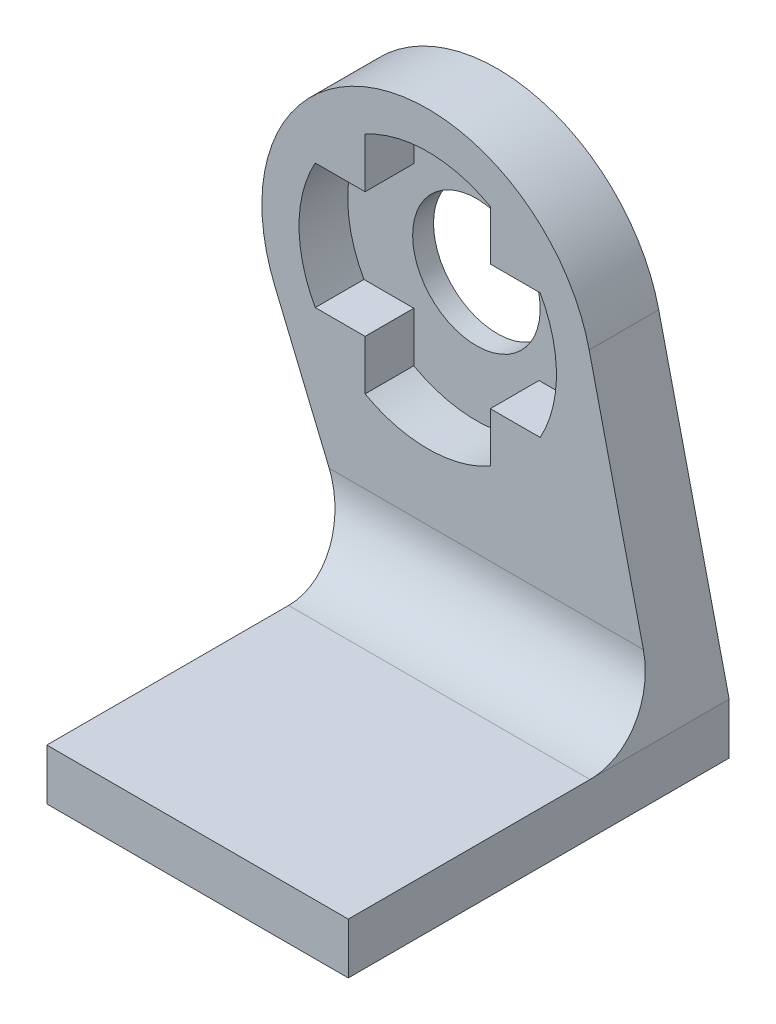
ISO-10303-21;
HEADER;
FILE_DESCRIPTION(('STEP AP214'),'2;1');
FILE_NAME('part.step','',(''),(''),'','','');
FILE_SCHEMA(('AUTOMOTIVE_DESIGN { 1 0 10303 214 1 1 1 1 }'));
ENDSEC;
DATA;
#1=APPLICATION_CONTEXT('core data for automotive mechanical design processes');
#2=APPLICATION_PROTOCOL_DEFINITION('international standard','automotive_design',2000,#1);
#3=PRODUCT_CONTEXT('',#1,'mechanical');
#4=PRODUCT('Part','Part','',(#3));
#5=PRODUCT_RELATED_PRODUCT_CATEGORY('part','',(#4));
#6=PRODUCT_DEFINITION_FORMATION('','',#4);
#7=PRODUCT_DEFINITION_CONTEXT('part definition',#1,'design');
#8=PRODUCT_DEFINITION('design','',#6,#7);
#9=PRODUCT_DEFINITION_SHAPE('','',#8);
#10=(LENGTH_UNIT() NAMED_UNIT(*) SI_UNIT(.MILLI.,.METRE.));
#11=(NAMED_UNIT(*) PLANE_ANGLE_UNIT() SI_UNIT($,.RADIAN.));
#12=(NAMED_UNIT(*) SI_UNIT($,.STERADIAN.) SOLID_ANGLE_UNIT());
#13=UNCERTAINTY_MEASURE_WITH_UNIT(LENGTH_MEASURE(1.E-05),#10,'distance_accuracy_value','');
#14=(GEOMETRIC_REPRESENTATION_CONTEXT(3) GLOBAL_UNCERTAINTY_ASSIGNED_CONTEXT((#13)) GLOBAL_UNIT_ASSIGNED_CONTEXT((#10,
#11,#12)) REPRESENTATION_CONTEXT('',''));
#15=CARTESIAN_POINT('',(0.,0.,0.));
#16=DIRECTION('',(0.,0.,1.));
#17=DIRECTION('',(1.,0.,0.));
#18=AXIS2_PLACEMENT_3D('',#15,#16,#17);
#19=CARTESIAN_POINT('',(12.9998092376302,-81.8996521323785,-19.85));
#20=DIRECTION('',(0.,0.,1.));
#21=DIRECTION('',(-1.,0.,0.));
#22=AXIS2_PLACEMENT_3D('',#19,#20,#21);
#23=PLANE('',#22);
#24=CARTESIAN_POINT('',(12.9999812376302,-81.8993076323785,-19.85));
#25=DIRECTION('',(0.,0.,-1.));
#26=DIRECTION('',(-1.,0.,0.));
#27=AXIS2_PLACEMENT_3D('',#24,#25,#26);
#28=CIRCLE('',#27,2.75);
#29=CARTESIAN_POINT('',(10.2499812376302,-81.8993076323785,-19.85));
#30=VERTEX_POINT('',#29);
#31=EDGE_CURVE('E367',#30,#30,#28,.T.);
#32=ORIENTED_EDGE('',*,*,#31,.T.);
#33=EDGE_LOOP('',(#32));
#34=FACE_BOUND('',#33,.T.);
#35=DIRECTION('',(0.,-1.,0.));
#36=VECTOR('',#35,1.);
#37=CARTESIAN_POINT('',(15.6998092376302,-77.1372997724622,-19.85));
#38=LINE('',#37,#36);
#39=CARTESIAN_POINT('',(15.6998092376302,-77.0506831698051,-19.85));
#40=VERTEX_POINT('',#39);
#41=CARTESIAN_POINT('',(15.6998092376302,-79.1996521323784,-19.85));
#42=VERTEX_POINT('',#41);
#43=EDGE_CURVE('E298',#40,#42,#38,.T.);
#44=ORIENTED_EDGE('',*,*,#43,.F.);
#45=CARTESIAN_POINT('',(12.9998092376302,-81.8996521323785,-19.85));
#46=DIRECTION('',(0.,0.,-1.));
#47=DIRECTION('',(-1.,0.,0.));
#48=AXIS2_PLACEMENT_3D('',#45,#46,#47);
#49=CIRCLE('',#48,5.55000000000001);
#50=CARTESIAN_POINT('',(10.2998092376302,-77.0506831698051,-19.85));
#51=VERTEX_POINT('',#50);
#52=EDGE_CURVE('E264',#51,#40,#49,.T.);
#53=ORIENTED_EDGE('',*,*,#52,.F.);
#54=DIRECTION('',(0.,1.,0.));
#55=VECTOR('',#54,1.);
#56=CARTESIAN_POINT('',(10.2998092376302,-77.1372997724622,-19.85));
#57=LINE('',#56,#55);
#58=CARTESIAN_POINT('',(10.2998092376302,-79.1996521323784,-19.85));
#59=VERTEX_POINT('',#58);
#60=EDGE_CURVE('E335',#59,#51,#57,.T.);
#61=ORIENTED_EDGE('',*,*,#60,.F.);
#62=DIRECTION('',(1.,0.,0.));
#63=VECTOR('',#62,1.);
#64=CARTESIAN_POINT('',(8.23745687771393,-79.1996521323784,-19.85));
#65=LINE('',#64,#63);
#66=CARTESIAN_POINT('',(8.15084027505681,-79.1996521323784,-19.85));
#67=VERTEX_POINT('',#66);
#68=EDGE_CURVE('E338',#67,#59,#65,.T.);
#69=ORIENTED_EDGE('',*,*,#68,.F.);
#70=CARTESIAN_POINT('',(12.9998092376302,-81.8996521323785,-19.85));
#71=DIRECTION('',(0.,0.,-1.));
#72=DIRECTION('',(-1.,0.,0.));
#73=AXIS2_PLACEMENT_3D('',#70,#71,#72);
#74=CIRCLE('',#73,5.55);
#75=CARTESIAN_POINT('',(8.15084027505681,-84.5996521323785,-19.85));
#76=VERTEX_POINT('',#75);
#77=EDGE_CURVE('E341',#76,#67,#74,.T.);
#78=ORIENTED_EDGE('',*,*,#77,.F.);
#79=DIRECTION('',(-1.,0.,0.));
#80=VECTOR('',#79,1.);
#81=CARTESIAN_POINT('',(8.23745687771393,-84.5996521323785,-19.85));
#82=LINE('',#81,#80);
#83=CARTESIAN_POINT('',(10.2998092376302,-84.5996521323785,-19.85));
#84=VERTEX_POINT('',#83);
#85=EDGE_CURVE('E344',#84,#76,#82,.T.);
#86=ORIENTED_EDGE('',*,*,#85,.F.);
#87=DIRECTION('',(0.,1.,0.));
#88=VECTOR('',#87,1.);
#89=CARTESIAN_POINT('',(10.2998092376302,-86.6620044922947,-19.85));
#90=LINE('',#89,#88);
#91=CARTESIAN_POINT('',(10.2998092376302,-86.7486210949518,-19.85));
#92=VERTEX_POINT('',#91);
#93=EDGE_CURVE('E347',#92,#84,#90,.T.);
#94=ORIENTED_EDGE('',*,*,#93,.F.);
#95=CARTESIAN_POINT('',(12.9998092376302,-81.8996521323785,-19.85));
#96=DIRECTION('',(0.,0.,-1.));
#97=DIRECTION('',(-1.,0.,0.));
#98=AXIS2_PLACEMENT_3D('',#95,#96,#97);
#99=CIRCLE('',#98,5.55000000000001);
#100=CARTESIAN_POINT('',(15.6998092376302,-86.7486210949518,-19.85));
#101=VERTEX_POINT('',#100);
#102=EDGE_CURVE('E350',#101,#92,#99,.T.);
#103=ORIENTED_EDGE('',*,*,#102,.F.);
#104=DIRECTION('',(0.,-1.,0.));
#105=VECTOR('',#104,1.);
#106=CARTESIAN_POINT('',(15.6998092376302,-86.6620044922947,-19.85));
#107=LINE('',#106,#105);
#108=CARTESIAN_POINT('',(15.6998092376302,-84.5996521323785,-19.85));
#109=VERTEX_POINT('',#108);
#110=EDGE_CURVE('E353',#109,#101,#107,.T.);
#111=ORIENTED_EDGE('',*,*,#110,.F.);
#112=DIRECTION('',(-1.,0.,0.));
#113=VECTOR('',#112,1.);
#114=CARTESIAN_POINT('',(17.7621615975465,-84.5996521323785,-19.85));
#115=LINE('',#114,#113);
#116=CARTESIAN_POINT('',(17.8487782002036,-84.5996521323785,-19.85));
#117=VERTEX_POINT('',#116);
#118=EDGE_CURVE('E356',#117,#109,#115,.T.);
#119=ORIENTED_EDGE('',*,*,#118,.F.);
#120=CARTESIAN_POINT('',(12.9998092376302,-81.8996521323785,-19.85));
#121=DIRECTION('',(0.,0.,-1.));
#122=DIRECTION('',(-1.,0.,0.));
#123=AXIS2_PLACEMENT_3D('',#120,#121,#122);
#124=CIRCLE('',#123,5.55000000000001);
#125=CARTESIAN_POINT('',(17.8487782002036,-79.1996521323784,-19.85));
#126=VERTEX_POINT('',#125);
#127=EDGE_CURVE('E359',#126,#117,#124,.T.);
#128=ORIENTED_EDGE('',*,*,#127,.F.);
#129=DIRECTION('',(1.,0.,0.));
#130=VECTOR('',#129,1.);
#131=CARTESIAN_POINT('',(17.7621615975465,-79.1996521323784,-19.85));
#132=LINE('',#131,#130);
#133=EDGE_CURVE('E362',#42,#126,#132,.T.);
#134=ORIENTED_EDGE('',*,*,#133,.F.);
#135=EDGE_LOOP('',(#44,#53,#61,#69,#78,#86,#94,#103,#111,#119,#128,#134));
#136=FACE_BOUND('',#135,.T.);
#137=ADVANCED_FACE('F34',(#34,#136),#23,.T.);
#138=CARTESIAN_POINT('',(17.7621615975465,-79.1996521323784,-19.85));
#139=DIRECTION('',(0.,1.,0.));
#140=DIRECTION('',(0.,0.,1.));
#141=AXIS2_PLACEMENT_3D('',#138,#139,#140);
#142=PLANE('',#141);
#143=DIRECTION('',(1.,0.,0.));
#144=VECTOR('',#143,1.);
#145=CARTESIAN_POINT('',(17.7621615975465,-79.1996521323784,-17.75));
#146=LINE('',#145,#144);
#147=CARTESIAN_POINT('',(15.6998092376302,-79.1996521323784,-17.75));
#148=VERTEX_POINT('',#147);
#149=CARTESIAN_POINT('',(17.8487782002036,-79.1996521323784,-17.75));
#150=VERTEX_POINT('',#149);
#151=EDGE_CURVE('E329',#148,#150,#146,.T.);
#152=ORIENTED_EDGE('',*,*,#151,.F.);
#153=DIRECTION('',(0.,0.,1.));
#154=VECTOR('',#153,1.);
#155=CARTESIAN_POINT('',(15.6998092376302,-79.1996521323784,-19.85));
#156=LINE('',#155,#154);
#157=EDGE_CURVE('E260',#42,#148,#156,.T.);
#158=ORIENTED_EDGE('',*,*,#157,.F.);
#159=ORIENTED_EDGE('',*,*,#133,.T.);
#160=DIRECTION('',(0.,0.,1.));
#161=VECTOR('',#160,1.);
#162=CARTESIAN_POINT('',(17.8487782002036,-79.1996521323784,-19.85));
#163=LINE('',#162,#161);
#164=EDGE_CURVE('E263',#126,#150,#163,.T.);
#165=ORIENTED_EDGE('',*,*,#164,.T.);
#166=EDGE_LOOP('',(#152,#158,#159,#165));
#167=FACE_BOUND('',#166,.T.);
#168=ADVANCED_FACE('F397',(#167),#142,.F.);
#169=CARTESIAN_POINT('',(12.9998092376302,-81.8996521323785,-19.85));
#170=DIRECTION('',(0.,0.,1.));
#171=DIRECTION('',(-1.,0.,0.));
#172=AXIS2_PLACEMENT_3D('',#169,#170,#171);
#173=CYLINDRICAL_SURFACE('',#172,5.55000000000001);
#174=CARTESIAN_POINT('',(12.9998092376302,-81.8996521323785,-17.75));
#175=DIRECTION('',(0.,0.,-1.));
#176=DIRECTION('',(-1.,0.,0.));
#177=AXIS2_PLACEMENT_3D('',#174,#175,#176);
#178=CIRCLE('',#177,5.55000000000001);
#179=CARTESIAN_POINT('',(17.8487782002036,-84.5996521323785,-17.75));
#180=VERTEX_POINT('',#179);
#181=EDGE_CURVE('E326',#150,#180,#178,.T.);
#182=ORIENTED_EDGE('',*,*,#181,.F.);
#183=ORIENTED_EDGE('',*,*,#164,.F.);
#184=ORIENTED_EDGE('',*,*,#127,.T.);
#185=DIRECTION('',(0.,0.,1.));
#186=VECTOR('',#185,1.);
#187=CARTESIAN_POINT('',(17.8487782002036,-84.5996521323785,-19.85));
#188=LINE('',#187,#186);
#189=EDGE_CURVE('E267',#117,#180,#188,.T.);
#190=ORIENTED_EDGE('',*,*,#189,.T.);
#191=EDGE_LOOP('',(#182,#183,#184,#190));
#192=FACE_BOUND('',#191,.T.);
#193=ADVANCED_FACE('F403',(#192),#173,.F.);
#194=CARTESIAN_POINT('',(17.7621615975465,-84.5996521323785,-19.85));
#195=DIRECTION('',(0.,-1.,0.));
#196=DIRECTION('',(0.,0.,-1.));
#197=AXIS2_PLACEMENT_3D('',#194,#195,#196);
#198=PLANE('',#197);
#199=DIRECTION('',(-1.,0.,0.));
#200=VECTOR('',#199,1.);
#201=CARTESIAN_POINT('',(17.7621615975465,-84.5996521323785,-17.75));
#202=LINE('',#201,#200);
#203=CARTESIAN_POINT('',(15.6998092376302,-84.5996521323785,-17.75));
#204=VERTEX_POINT('',#203);
#205=EDGE_CURVE('E323',#180,#204,#202,.T.);
#206=ORIENTED_EDGE('',*,*,#205,.F.);
#207=ORIENTED_EDGE('',*,*,#189,.F.);
#208=ORIENTED_EDGE('',*,*,#118,.T.);
#209=DIRECTION('',(0.,0.,1.));
#210=VECTOR('',#209,1.);
#211=CARTESIAN_POINT('',(15.6998092376302,-84.5996521323785,-19.85));
#212=LINE('',#211,#210);
#213=EDGE_CURVE('E270',#109,#204,#212,.T.);
#214=ORIENTED_EDGE('',*,*,#213,.T.);
#215=EDGE_LOOP('',(#206,#207,#208,#214));
#216=FACE_BOUND('',#215,.T.);
#217=ADVANCED_FACE('F444',(#216),#198,.F.);
#218=CARTESIAN_POINT('',(15.6998092376302,-86.6620044922947,-19.85));
#219=DIRECTION('',(1.,0.,0.));
#220=DIRECTION('',(0.,0.,1.));
#221=AXIS2_PLACEMENT_3D('',#218,#219,#220);
#222=PLANE('',#221);
#223=DIRECTION('',(0.,-1.,0.));
#224=VECTOR('',#223,1.);
#225=CARTESIAN_POINT('',(15.6998092376302,-86.6620044922947,-17.75));
#226=LINE('',#225,#224);
#227=CARTESIAN_POINT('',(15.6998092376302,-86.7486210949518,-17.75));
#228=VERTEX_POINT('',#227);
#229=EDGE_CURVE('E320',#204,#228,#226,.T.);
#230=ORIENTED_EDGE('',*,*,#229,.F.);
#231=ORIENTED_EDGE('',*,*,#213,.F.);
#232=ORIENTED_EDGE('',*,*,#110,.T.);
#233=DIRECTION('',(0.,0.,1.));
#234=VECTOR('',#233,1.);
#235=CARTESIAN_POINT('',(15.6998092376302,-86.7486210949518,-19.85));
#236=LINE('',#235,#234);
#237=EDGE_CURVE('E273',#101,#228,#236,.T.);
#238=ORIENTED_EDGE('',*,*,#237,.T.);
#239=EDGE_LOOP('',(#230,#231,#232,#238));
#240=FACE_BOUND('',#239,.T.);
#241=ADVANCED_FACE('F440',(#240),#222,.F.);
#242=CARTESIAN_POINT('',(12.9998092376302,-81.8996521323785,-19.85));
#243=DIRECTION('',(0.,0.,1.));
#244=DIRECTION('',(-1.,0.,0.));
#245=AXIS2_PLACEMENT_3D('',#242,#243,#244);
#246=CYLINDRICAL_SURFACE('',#245,5.55000000000001);
#247=CARTESIAN_POINT('',(12.9998092376302,-81.8996521323785,-17.75));
#248=DIRECTION('',(0.,0.,-1.));
#249=DIRECTION('',(-1.,0.,0.));
#250=AXIS2_PLACEMENT_3D('',#247,#248,#249);
#251=CIRCLE('',#250,5.55000000000001);
#252=CARTESIAN_POINT('',(10.2998092376302,-86.7486210949518,-17.75));
#253=VERTEX_POINT('',#252);
#254=EDGE_CURVE('E317',#228,#253,#251,.T.);
#255=ORIENTED_EDGE('',*,*,#254,.F.);
#256=ORIENTED_EDGE('',*,*,#237,.F.);
#257=ORIENTED_EDGE('',*,*,#102,.T.);
#258=DIRECTION('',(0.,0.,1.));
#259=VECTOR('',#258,1.);
#260=CARTESIAN_POINT('',(10.2998092376302,-86.7486210949518,-19.85));
#261=LINE('',#260,#259);
#262=EDGE_CURVE('E276',#92,#253,#261,.T.);
#263=ORIENTED_EDGE('',*,*,#262,.T.);
#264=EDGE_LOOP('',(#255,#256,#257,#263));
#265=FACE_BOUND('',#264,.T.);
#266=ADVANCED_FACE('F436',(#265),#246,.F.);
#267=CARTESIAN_POINT('',(10.2998092376302,-86.6620044922947,-19.85));
#268=DIRECTION('',(-1.,0.,0.));
#269=DIRECTION('',(0.,0.,-1.));
#270=AXIS2_PLACEMENT_3D('',#267,#268,#269);
#271=PLANE('',#270);
#272=DIRECTION('',(0.,1.,0.));
#273=VECTOR('',#272,1.);
#274=CARTESIAN_POINT('',(10.2998092376302,-86.6620044922947,-17.75));
#275=LINE('',#274,#273);
#276=CARTESIAN_POINT('',(10.2998092376302,-84.5996521323785,-17.75));
#277=VERTEX_POINT('',#276);
#278=EDGE_CURVE('E314',#253,#277,#275,.T.);
#279=ORIENTED_EDGE('',*,*,#278,.F.);
#280=ORIENTED_EDGE('',*,*,#262,.F.);
#281=ORIENTED_EDGE('',*,*,#93,.T.);
#282=DIRECTION('',(0.,0.,1.));
#283=VECTOR('',#282,1.);
#284=CARTESIAN_POINT('',(10.2998092376302,-84.5996521323785,-19.85));
#285=LINE('',#284,#283);
#286=EDGE_CURVE('E279',#84,#277,#285,.T.);
#287=ORIENTED_EDGE('',*,*,#286,.T.);
#288=EDGE_LOOP('',(#279,#280,#281,#287));
#289=FACE_BOUND('',#288,.T.);
#290=ADVANCED_FACE('F432',(#289),#271,.F.);
#291=CARTESIAN_POINT('',(8.23745687771393,-84.5996521323785,-19.85));
#292=DIRECTION('',(0.,-1.,0.));
#293=DIRECTION('',(0.,0.,-1.));
#294=AXIS2_PLACEMENT_3D('',#291,#292,#293);
#295=PLANE('',#294);
#296=DIRECTION('',(-1.,0.,0.));
#297=VECTOR('',#296,1.);
#298=CARTESIAN_POINT('',(8.23745687771393,-84.5996521323785,-17.75));
#299=LINE('',#298,#297);
#300=CARTESIAN_POINT('',(8.15084027505681,-84.5996521323785,-17.75));
#301=VERTEX_POINT('',#300);
#302=EDGE_CURVE('E311',#277,#301,#299,.T.);
#303=ORIENTED_EDGE('',*,*,#302,.F.);
#304=ORIENTED_EDGE('',*,*,#286,.F.);
#305=ORIENTED_EDGE('',*,*,#85,.T.);
#306=DIRECTION('',(0.,0.,1.));
#307=VECTOR('',#306,1.);
#308=CARTESIAN_POINT('',(8.15084027505681,-84.5996521323785,-19.85));
#309=LINE('',#308,#307);
#310=EDGE_CURVE('E282',#76,#301,#309,.T.);
#311=ORIENTED_EDGE('',*,*,#310,.T.);
#312=EDGE_LOOP('',(#303,#304,#305,#311));
#313=FACE_BOUND('',#312,.T.);
#314=ADVANCED_FACE('F428',(#313),#295,.F.);
#315=CARTESIAN_POINT('',(12.9998092376302,-81.8996521323785,-19.85));
#316=DIRECTION('',(0.,0.,1.));
#317=DIRECTION('',(-1.,0.,0.));
#318=AXIS2_PLACEMENT_3D('',#315,#316,#317);
#319=CYLINDRICAL_SURFACE('',#318,5.55);
#320=CARTESIAN_POINT('',(12.9998092376302,-81.8996521323785,-17.75));
#321=DIRECTION('',(0.,0.,-1.));
#322=DIRECTION('',(-1.,0.,0.));
#323=AXIS2_PLACEMENT_3D('',#320,#321,#322);
#324=CIRCLE('',#323,5.55);
#325=CARTESIAN_POINT('',(8.15084027505681,-79.1996521323784,-17.75));
#326=VERTEX_POINT('',#325);
#327=EDGE_CURVE('E308',#301,#326,#324,.T.);
#328=ORIENTED_EDGE('',*,*,#327,.F.);
#329=ORIENTED_EDGE('',*,*,#310,.F.);
#330=ORIENTED_EDGE('',*,*,#77,.T.);
#331=DIRECTION('',(0.,0.,1.));
#332=VECTOR('',#331,1.);
#333=CARTESIAN_POINT('',(8.15084027505681,-79.1996521323784,-19.85));
#334=LINE('',#333,#332);
#335=EDGE_CURVE('E285',#67,#326,#334,.T.);
#336=ORIENTED_EDGE('',*,*,#335,.T.);
#337=EDGE_LOOP('',(#328,#329,#330,#336));
#338=FACE_BOUND('',#337,.T.);
#339=ADVANCED_FACE('F424',(#338),#319,.F.);
#340=CARTESIAN_POINT('',(8.23745687771393,-79.1996521323784,-19.85));
#341=DIRECTION('',(0.,1.,0.));
#342=DIRECTION('',(0.,0.,1.));
#343=AXIS2_PLACEMENT_3D('',#340,#341,#342);
#344=PLANE('',#343);
#345=DIRECTION('',(1.,0.,0.));
#346=VECTOR('',#345,1.);
#347=CARTESIAN_POINT('',(8.23745687771393,-79.1996521323784,-17.75));
#348=LINE('',#347,#346);
#349=CARTESIAN_POINT('',(10.2998092376302,-79.1996521323784,-17.75));
#350=VERTEX_POINT('',#349);
#351=EDGE_CURVE('E305',#326,#350,#348,.T.);
#352=ORIENTED_EDGE('',*,*,#351,.F.);
#353=ORIENTED_EDGE('',*,*,#335,.F.);
#354=ORIENTED_EDGE('',*,*,#68,.T.);
#355=DIRECTION('',(0.,0.,1.));
#356=VECTOR('',#355,1.);
#357=CARTESIAN_POINT('',(10.2998092376302,-79.1996521323784,-19.85));
#358=LINE('',#357,#356);
#359=EDGE_CURVE('E288',#59,#350,#358,.T.);
#360=ORIENTED_EDGE('',*,*,#359,.T.);
#361=EDGE_LOOP('',(#352,#353,#354,#360));
#362=FACE_BOUND('',#361,.T.);
#363=ADVANCED_FACE('F420',(#362),#344,.F.);
#364=CARTESIAN_POINT('',(10.2998092376302,-77.1372997724622,-19.85));
#365=DIRECTION('',(-1.,0.,0.));
#366=DIRECTION('',(0.,0.,-1.));
#367=AXIS2_PLACEMENT_3D('',#364,#365,#366);
#368=PLANE('',#367);
#369=DIRECTION('',(0.,1.,0.));
#370=VECTOR('',#369,1.);
#371=CARTESIAN_POINT('',(10.2998092376302,-77.1372997724622,-17.75));
#372=LINE('',#371,#370);
#373=CARTESIAN_POINT('',(10.2998092376302,-77.0506831698051,-17.75));
#374=VERTEX_POINT('',#373);
#375=EDGE_CURVE('E302',#350,#374,#372,.T.);
#376=ORIENTED_EDGE('',*,*,#375,.F.);
#377=ORIENTED_EDGE('',*,*,#359,.F.);
#378=ORIENTED_EDGE('',*,*,#60,.T.);
#379=DIRECTION('',(0.,0.,1.));
#380=VECTOR('',#379,1.);
#381=CARTESIAN_POINT('',(10.2998092376302,-77.0506831698051,-19.85));
#382=LINE('',#381,#380);
#383=EDGE_CURVE('E291',#51,#374,#382,.T.);
#384=ORIENTED_EDGE('',*,*,#383,.T.);
#385=EDGE_LOOP('',(#376,#377,#378,#384));
#386=FACE_BOUND('',#385,.T.);
#387=ADVANCED_FACE('F416',(#386),#368,.F.);
#388=CARTESIAN_POINT('',(12.9998092376302,-81.8996521323785,-19.85));
#389=DIRECTION('',(0.,0.,1.));
#390=DIRECTION('',(-1.,0.,0.));
#391=AXIS2_PLACEMENT_3D('',#388,#389,#390);
#392=CYLINDRICAL_SURFACE('',#391,5.55000000000001);
#393=CARTESIAN_POINT('',(12.9998092376302,-81.8996521323785,-17.75));
#394=DIRECTION('',(0.,0.,-1.));
#395=DIRECTION('',(-1.,0.,0.));
#396=AXIS2_PLACEMENT_3D('',#393,#394,#395);
#397=CIRCLE('',#396,5.55000000000001);
#398=CARTESIAN_POINT('',(15.6998092376302,-77.0506831698051,-17.75));
#399=VERTEX_POINT('',#398);
#400=EDGE_CURVE('E299',#374,#399,#397,.T.);
#401=ORIENTED_EDGE('',*,*,#400,.F.);
#402=ORIENTED_EDGE('',*,*,#383,.F.);
#403=ORIENTED_EDGE('',*,*,#52,.T.);
#404=DIRECTION('',(0.,0.,1.));
#405=VECTOR('',#404,1.);
#406=CARTESIAN_POINT('',(15.6998092376302,-77.0506831698051,-19.85));
#407=LINE('',#406,#405);
#408=EDGE_CURVE('E252',#40,#399,#407,.T.);
#409=ORIENTED_EDGE('',*,*,#408,.T.);
#410=EDGE_LOOP('',(#401,#402,#403,#409));
#411=FACE_BOUND('',#410,.T.);
#412=ADVANCED_FACE('F412',(#411),#392,.F.);
#413=CARTESIAN_POINT('',(15.6998092376302,-77.1372997724622,-19.85));
#414=DIRECTION('',(1.,0.,0.));
#415=DIRECTION('',(0.,0.,1.));
#416=AXIS2_PLACEMENT_3D('',#413,#414,#415);
#417=PLANE('',#416);
#418=DIRECTION('',(0.,-1.,0.));
#419=VECTOR('',#418,1.);
#420=CARTESIAN_POINT('',(15.6998092376302,-77.1372997724622,-17.75));
#421=LINE('',#420,#419);
#422=EDGE_CURVE('E296',#399,#148,#421,.T.);
#423=ORIENTED_EDGE('',*,*,#422,.F.);
#424=ORIENTED_EDGE('',*,*,#408,.F.);
#425=ORIENTED_EDGE('',*,*,#43,.T.);
#426=ORIENTED_EDGE('',*,*,#157,.T.);
#427=EDGE_LOOP('',(#423,#424,#425,#426));
#428=FACE_BOUND('',#427,.T.);
#429=ADVANCED_FACE('F409',(#428),#417,.F.);
#430=CARTESIAN_POINT('',(12.9998092376302,-81.8996521323785,-20.75));
#431=DIRECTION('',(0.,0.,1.));
#432=DIRECTION('',(-1.,0.,0.));
#433=AXIS2_PLACEMENT_3D('',#430,#431,#432);
#434=CYLINDRICAL_SURFACE('',#433,7.15);
#435=CARTESIAN_POINT('',(12.9998092376302,-81.8996521323785,-17.75));
#436=DIRECTION('',(0.,0.,-1.));
#437=DIRECTION('',(-1.,0.,0.));
#438=AXIS2_PLACEMENT_3D('',#435,#436,#437);
#439=CIRCLE('',#438,7.15);
#440=CARTESIAN_POINT('',(6.39866542691876,-84.6469053770405,-17.75));
#441=VERTEX_POINT('',#440);
#442=CARTESIAN_POINT('',(19.9629923190944,-80.2758968016679,-17.75));
#443=VERTEX_POINT('',#442);
#444=EDGE_CURVE('E243',#441,#443,#439,.T.);
#445=ORIENTED_EDGE('',*,*,#444,.T.);
#446=DIRECTION('',(0.,0.,1.));
#447=VECTOR('',#446,1.);
#448=CARTESIAN_POINT('',(19.9629923190944,-80.2758968016679,-20.75));
#449=LINE('',#448,#447);
#450=CARTESIAN_POINT('',(19.9629923190944,-80.2758968016679,-20.75));
#451=VERTEX_POINT('',#450);
#452=EDGE_CURVE('E229',#451,#443,#449,.T.);
#453=ORIENTED_EDGE('',*,*,#452,.F.);
#454=CARTESIAN_POINT('',(12.9998092376302,-81.8996521323785,-20.75));
#455=DIRECTION('',(0.,0.,-1.));
#456=DIRECTION('',(-1.,0.,0.));
#457=AXIS2_PLACEMENT_3D('',#454,#455,#456);
#458=CIRCLE('',#457,7.15);
#459=CARTESIAN_POINT('',(6.39866542691876,-84.6469053770405,-20.75));
#460=VERTEX_POINT('',#459);
#461=EDGE_CURVE('E232',#460,#451,#458,.T.);
#462=ORIENTED_EDGE('',*,*,#461,.F.);
#463=DIRECTION('',(0.,0.,1.));
#464=VECTOR('',#463,1.);
#465=CARTESIAN_POINT('',(6.39866542691876,-84.6469053770405,-20.75));
#466=LINE('',#465,#464);
#467=EDGE_CURVE('E225',#460,#441,#466,.T.);
#468=ORIENTED_EDGE('',*,*,#467,.T.);
#469=EDGE_LOOP('',(#445,#453,#462,#468));
#470=FACE_BOUND('',#469,.T.);
#471=ADVANCED_FACE('F257',(#470),#434,.T.);
#472=CARTESIAN_POINT('',(12.9999812376302,-81.8993076323785,-20.75));
#473=DIRECTION('',(0.,0.,1.));
#474=DIRECTION('',(-1.,0.,0.));
#475=AXIS2_PLACEMENT_3D('',#472,#473,#474);
#476=CYLINDRICAL_SURFACE('',#475,2.75);
#477=CARTESIAN_POINT('',(12.9999812376302,-81.8993076323785,-20.75));
#478=DIRECTION('',(0.,0.,-1.));
#479=DIRECTION('',(-1.,0.,0.));
#480=AXIS2_PLACEMENT_3D('',#477,#478,#479);
#481=CIRCLE('',#480,2.75);
#482=CARTESIAN_POINT('',(10.2499812376302,-81.8993076323785,-20.75));
#483=VERTEX_POINT('',#482);
#484=EDGE_CURVE('E332',#483,#483,#481,.T.);
#485=ORIENTED_EDGE('',*,*,#484,.T.);
#486=EDGE_LOOP('',(#485));
#487=FACE_BOUND('',#486,.T.);
#488=ORIENTED_EDGE('',*,*,#31,.F.);
#489=EDGE_LOOP('',(#488));
#490=FACE_BOUND('',#489,.T.);
#491=ADVANCED_FACE('F385',(#487,#490),#476,.F.);
#492=CARTESIAN_POINT('',(12.9998092376302,-81.8996521323785,-17.75));
#493=DIRECTION('',(0.,0.,1.));
#494=DIRECTION('',(-1.,0.,0.));
#495=AXIS2_PLACEMENT_3D('',#492,#493,#494);
#496=PLANE('',#495);
#497=ORIENTED_EDGE('',*,*,#422,.T.);
#498=ORIENTED_EDGE('',*,*,#151,.T.);
#499=ORIENTED_EDGE('',*,*,#181,.T.);
#500=ORIENTED_EDGE('',*,*,#205,.T.);
#501=ORIENTED_EDGE('',*,*,#229,.T.);
#502=ORIENTED_EDGE('',*,*,#254,.T.);
#503=ORIENTED_EDGE('',*,*,#278,.T.);
#504=ORIENTED_EDGE('',*,*,#302,.T.);
#505=ORIENTED_EDGE('',*,*,#327,.T.);
#506=ORIENTED_EDGE('',*,*,#351,.T.);
#507=ORIENTED_EDGE('',*,*,#375,.T.);
#508=ORIENTED_EDGE('',*,*,#400,.T.);
#509=EDGE_LOOP('',(#497,#498,#499,#500,#501,#502,#503,#504,#505,#506,#507,#508));
#510=FACE_BOUND('',#509,.T.);
#511=DIRECTION('',(0.227098647651831,-0.973871759645339,0.));
#512=VECTOR('',#511,1.);
#513=CARTESIAN_POINT('',(23.0000603569878,-93.2998175726996,-17.75));
#514=LINE('',#513,#512);
#515=CARTESIAN_POINT('',(22.3004857608381,-90.2998175726996,-17.75));
#516=VERTEX_POINT('',#515);
#517=EDGE_CURVE('E241',#443,#516,#514,.T.);
#518=ORIENTED_EDGE('',*,*,#517,.F.);
#519=ORIENTED_EDGE('',*,*,#444,.F.);
#520=DIRECTION('',(-0.384231223029655,0.923236896602998,0.));
#521=VECTOR('',#520,1.);
#522=CARTESIAN_POINT('',(9.99982028537324,-93.2998175726996,-17.75));
#523=LINE('',#522,#521);
#524=CARTESIAN_POINT('',(8.75128518746907,-90.2998175726996,-17.75));
#525=VERTEX_POINT('',#524);
#526=EDGE_CURVE('E196',#525,#441,#523,.T.);
#527=ORIENTED_EDGE('',*,*,#526,.F.);
#528=DIRECTION('',(-1.,0.,0.));
#529=VECTOR('',#528,1.);
#530=CARTESIAN_POINT('',(12.9998092376302,-90.2998175726996,-17.75));
#531=LINE('',#530,#529);
#532=EDGE_CURVE('E209',#516,#525,#531,.T.);
#533=ORIENTED_EDGE('',*,*,#532,.F.);
#534=EDGE_LOOP('',(#518,#519,#527,#533));
#535=FACE_BOUND('',#534,.T.);
#536=ADVANCED_FACE('F383',(#510,#535),#496,.T.);
#537=CARTESIAN_POINT('',(23.0000603569878,-93.2998175726996,-20.75));
#538=DIRECTION('',(0.973871759645339,0.227098647651831,0.));
#539=DIRECTION('',(0.227098647651831,-0.973871759645339,0.));
#540=AXIS2_PLACEMENT_3D('',#537,#538,#539);
#541=PLANE('',#540);
#542=ORIENTED_EDGE('',*,*,#517,.T.);
#543=CARTESIAN_POINT('',(22.3004857608381,-90.2998175726996,-14.75));
#544=DIRECTION('',(-0.973871759645339,-0.227098647651831,0.));
#545=DIRECTION('',(-0.227098647651831,0.973871759645339,0.));
#546=AXIS2_PLACEMENT_3D('',#543,#544,#545);
#547=ELLIPSE('',#546,3.08048772365319,3.);
#548=CARTESIAN_POINT('',(23.0000603569878,-93.2998175726996,-14.75));
#549=VERTEX_POINT('',#548);
#550=EDGE_CURVE('E11',#549,#516,#547,.F.);
#551=ORIENTED_EDGE('',*,*,#550,.F.);
#552=DIRECTION('',(0.,0.,1.));
#553=VECTOR('',#552,1.);
#554=CARTESIAN_POINT('',(23.0000603569878,-93.2998175726996,-20.75));
#555=LINE('',#554,#553);
#556=CARTESIAN_POINT('',(23.0000603569878,-93.2998175726996,-20.75));
#557=VERTEX_POINT('',#556);
#558=EDGE_CURVE('E185',#557,#549,#555,.T.);
#559=ORIENTED_EDGE('',*,*,#558,.F.);
#560=DIRECTION('',(0.227098647651831,-0.973871759645339,0.));
#561=VECTOR('',#560,1.);
#562=CARTESIAN_POINT('',(23.0000603569878,-93.2998175726996,-20.75));
#563=LINE('',#562,#561);
#564=EDGE_CURVE('E226',#451,#557,#563,.T.);
#565=ORIENTED_EDGE('',*,*,#564,.F.);
#566=ORIENTED_EDGE('',*,*,#452,.T.);
#567=EDGE_LOOP('',(#542,#551,#559,#565,#566));
#568=FACE_BOUND('',#567,.T.);
#569=ADVANCED_FACE('F254',(#568),#541,.T.);
#570=CARTESIAN_POINT('',(9.99982028537324,-93.2998175726996,-20.75));
#571=DIRECTION('',(-0.923236896602998,-0.384231223029655,0.));
#572=DIRECTION('',(-0.384231223029655,0.923236896602998,0.));
#573=AXIS2_PLACEMENT_3D('',#570,#571,#572);
#574=PLANE('',#573);
#575=ORIENTED_EDGE('',*,*,#526,.T.);
#576=ORIENTED_EDGE('',*,*,#467,.F.);
#577=DIRECTION('',(-0.384231223029655,0.923236896602998,0.));
#578=VECTOR('',#577,1.);
#579=CARTESIAN_POINT('',(9.99982028537324,-93.2998175726996,-20.75));
#580=LINE('',#579,#578);
#581=CARTESIAN_POINT('',(9.99982028537324,-93.2998175726996,-20.75));
#582=VERTEX_POINT('',#581);
#583=EDGE_CURVE('E222',#582,#460,#580,.T.);
#584=ORIENTED_EDGE('',*,*,#583,.F.);
#585=DIRECTION('',(0.,0.,1.));
#586=VECTOR('',#585,1.);
#587=CARTESIAN_POINT('',(9.99982028537324,-93.2998175726996,-20.75));
#588=LINE('',#587,#586);
#589=CARTESIAN_POINT('',(9.99982028537324,-93.2998175726996,-14.75));
#590=VERTEX_POINT('',#589);
#591=EDGE_CURVE('E219',#582,#590,#588,.T.);
#592=ORIENTED_EDGE('',*,*,#591,.T.);
#593=CARTESIAN_POINT('',(8.75128518746908,-90.2998175726996,-14.75));
#594=DIRECTION('',(0.923236896602998,0.384231223029655,0.));
#595=DIRECTION('',(-0.384231223029655,0.923236896602998,0.));
#596=AXIS2_PLACEMENT_3D('',#593,#594,#595);
#597=ELLIPSE('',#596,3.24943685747216,3.);
#598=EDGE_CURVE('E43',#525,#590,#597,.F.);
#599=ORIENTED_EDGE('',*,*,#598,.F.);
#600=EDGE_LOOP('',(#575,#576,#584,#592,#599));
#601=FACE_BOUND('',#600,.T.);
#602=ADVANCED_FACE('F220',(#601),#574,.T.);
#603=CARTESIAN_POINT('',(12.9998092376302,-81.8996521323785,-20.75));
#604=DIRECTION('',(0.,0.,1.));
#605=DIRECTION('',(-1.,0.,0.));
#606=AXIS2_PLACEMENT_3D('',#603,#604,#605);
#607=PLANE('',#606);
#608=ORIENTED_EDGE('',*,*,#484,.F.);
#609=EDGE_LOOP('',(#608));
#610=FACE_BOUND('',#609,.T.);
#611=ORIENTED_EDGE('',*,*,#583,.T.);
#612=ORIENTED_EDGE('',*,*,#461,.T.);
#613=ORIENTED_EDGE('',*,*,#564,.T.);
#614=DIRECTION('',(0.,1.,0.));
#615=VECTOR('',#614,1.);
#616=CARTESIAN_POINT('',(23.0000603569878,-95.4998175726996,-20.75));
#617=LINE('',#616,#615);
#618=CARTESIAN_POINT('',(23.0000603569878,-95.4998175726996,-20.75));
#619=VERTEX_POINT('',#618);
#620=EDGE_CURVE('E370',#619,#557,#617,.T.);
#621=ORIENTED_EDGE('',*,*,#620,.F.);
#622=DIRECTION('',(-1.,0.,0.));
#623=VECTOR('',#622,1.);
#624=CARTESIAN_POINT('',(23.0000603569878,-95.4998175726996,-20.75));
#625=LINE('',#624,#623);
#626=CARTESIAN_POINT('',(9.99982028537324,-95.4998175726996,-20.75));
#627=VERTEX_POINT('',#626);
#628=EDGE_CURVE('E375',#619,#627,#625,.T.);
#629=ORIENTED_EDGE('',*,*,#628,.T.);
#630=DIRECTION('',(0.,1.,0.));
#631=VECTOR('',#630,1.);
#632=CARTESIAN_POINT('',(9.99982028537324,-95.4998175726996,-20.75));
#633=LINE('',#632,#631);
#634=EDGE_CURVE('E206',#627,#582,#633,.T.);
#635=ORIENTED_EDGE('',*,*,#634,.T.);
#636=EDGE_LOOP('',(#611,#612,#613,#621,#629,#635));
#637=FACE_BOUND('',#636,.T.);
#638=ADVANCED_FACE('F381',(#610,#637),#607,.F.);
#639=CARTESIAN_POINT('',(0.,-95.4998175726996,0.));
#640=DIRECTION('',(0.,-1.,0.));
#641=DIRECTION('',(0.,0.,-1.));
#642=AXIS2_PLACEMENT_3D('',#639,#640,#641);
#643=PLANE('',#642);
#644=DIRECTION('',(-1.,0.,0.));
#645=VECTOR('',#644,1.);
#646=CARTESIAN_POINT('',(9.99982028537325,-95.4998175726996,-4.32499999999999));
#647=LINE('',#646,#645);
#648=CARTESIAN_POINT('',(23.0000603569878,-95.4998175726996,-4.32499999999999));
#649=VERTEX_POINT('',#648);
#650=CARTESIAN_POINT('',(9.99982028537325,-95.4998175726996,-4.32499999999999));
#651=VERTEX_POINT('',#650);
#652=EDGE_CURVE('E174',#649,#651,#647,.T.);
#653=ORIENTED_EDGE('',*,*,#652,.T.);
#654=DIRECTION('',(0.,0.,1.));
#655=VECTOR('',#654,1.);
#656=CARTESIAN_POINT('',(9.99982028537324,-95.4998175726996,12.45));
#657=LINE('',#656,#655);
#658=EDGE_CURVE('E202',#627,#651,#657,.T.);
#659=ORIENTED_EDGE('',*,*,#658,.F.);
#660=ORIENTED_EDGE('',*,*,#628,.F.);
#661=DIRECTION('',(0.,0.,-1.));
#662=VECTOR('',#661,1.);
#663=CARTESIAN_POINT('',(23.0000603569878,-95.4998175726996,12.45));
#664=LINE('',#663,#662);
#665=EDGE_CURVE('E188',#649,#619,#664,.T.);
#666=ORIENTED_EDGE('',*,*,#665,.F.);
#667=EDGE_LOOP('',(#653,#659,#660,#666));
#668=FACE_BOUND('',#667,.T.);
#669=ADVANCED_FACE('F380',(#668),#643,.T.);
#670=CARTESIAN_POINT('',(9.99982028537324,-95.4998175726996,12.45));
#671=DIRECTION('',(1.,0.,0.));
#672=DIRECTION('',(0.,0.,1.));
#673=AXIS2_PLACEMENT_3D('',#670,#671,#672);
#674=PLANE('',#673);
#675=ORIENTED_EDGE('',*,*,#591,.F.);
#676=ORIENTED_EDGE('',*,*,#634,.F.);
#677=ORIENTED_EDGE('',*,*,#658,.T.);
#678=DIRECTION('',(0.,-1.,0.));
#679=VECTOR('',#678,1.);
#680=CARTESIAN_POINT('',(9.99982028537325,-93.2998175726996,-4.32499999999999));
#681=LINE('',#680,#679);
#682=CARTESIAN_POINT('',(9.99982028537325,-93.2998175726996,-4.32499999999999));
#683=VERTEX_POINT('',#682);
#684=EDGE_CURVE('E181',#683,#651,#681,.T.);
#685=ORIENTED_EDGE('',*,*,#684,.F.);
#686=DIRECTION('',(0.,0.,1.));
#687=VECTOR('',#686,1.);
#688=CARTESIAN_POINT('',(9.99982028537324,-93.2998175726996,12.45));
#689=LINE('',#688,#687);
#690=EDGE_CURVE('E170',#590,#683,#689,.T.);
#691=ORIENTED_EDGE('',*,*,#690,.F.);
#692=EDGE_LOOP('',(#675,#676,#677,#685,#691));
#693=FACE_BOUND('',#692,.T.);
#694=ADVANCED_FACE('F457',(#693),#674,.F.);
#695=CARTESIAN_POINT('',(23.0000603569878,-95.4998175726996,12.45));
#696=DIRECTION('',(-1.,0.,0.));
#697=DIRECTION('',(0.,0.,-1.));
#698=AXIS2_PLACEMENT_3D('',#695,#696,#697);
#699=PLANE('',#698);
#700=ORIENTED_EDGE('',*,*,#665,.T.);
#701=ORIENTED_EDGE('',*,*,#620,.T.);
#702=ORIENTED_EDGE('',*,*,#558,.T.);
#703=DIRECTION('',(0.,0.,-1.));
#704=VECTOR('',#703,1.);
#705=CARTESIAN_POINT('',(23.0000603569878,-93.2998175726996,12.45));
#706=LINE('',#705,#704);
#707=CARTESIAN_POINT('',(23.0000603569878,-93.2998175726996,-4.325));
#708=VERTEX_POINT('',#707);
#709=EDGE_CURVE('E168',#708,#549,#706,.T.);
#710=ORIENTED_EDGE('',*,*,#709,.F.);
#711=DIRECTION('',(0.,-1.,0.));
#712=VECTOR('',#711,1.);
#713=CARTESIAN_POINT('',(23.0000603569878,-93.2998175726996,-4.325));
#714=LINE('',#713,#712);
#715=EDGE_CURVE('E173',#708,#649,#714,.T.);
#716=ORIENTED_EDGE('',*,*,#715,.T.);
#717=EDGE_LOOP('',(#700,#701,#702,#710,#716));
#718=FACE_BOUND('',#717,.T.);
#719=ADVANCED_FACE('F183',(#718),#699,.F.);
#720=CARTESIAN_POINT('',(0.,-93.2998175726996,0.));
#721=DIRECTION('',(0.,-1.,0.));
#722=DIRECTION('',(0.,0.,-1.));
#723=AXIS2_PLACEMENT_3D('',#720,#721,#722);
#724=PLANE('',#723);
#725=ORIENTED_EDGE('',*,*,#690,.T.);
#726=DIRECTION('',(-1.,0.,0.));
#727=VECTOR('',#726,1.);
#728=CARTESIAN_POINT('',(9.99982028537325,-93.2998175726996,-4.32499999999999));
#729=LINE('',#728,#727);
#730=EDGE_CURVE('E164',#708,#683,#729,.T.);
#731=ORIENTED_EDGE('',*,*,#730,.F.);
#732=ORIENTED_EDGE('',*,*,#709,.T.);
#733=DIRECTION('',(-1.,0.,0.));
#734=VECTOR('',#733,1.);
#735=CARTESIAN_POINT('',(0.,-93.2998175726996,-14.75));
#736=LINE('',#735,#734);
#737=EDGE_CURVE('E49',#590,#549,#736,.F.);
#738=ORIENTED_EDGE('',*,*,#737,.F.);
#739=EDGE_LOOP('',(#725,#731,#732,#738));
#740=FACE_BOUND('',#739,.T.);
#741=ADVANCED_FACE('F166',(#740),#724,.F.);
#742=CARTESIAN_POINT('',(9.99982028537325,-93.2998175726996,-4.32499999999999));
#743=DIRECTION('',(0.,0.,-1.));
#744=DIRECTION('',(1.,0.,0.));
#745=AXIS2_PLACEMENT_3D('',#742,#743,#744);
#746=PLANE('',#745);
#747=ORIENTED_EDGE('',*,*,#652,.F.);
#748=ORIENTED_EDGE('',*,*,#715,.F.);
#749=ORIENTED_EDGE('',*,*,#730,.T.);
#750=ORIENTED_EDGE('',*,*,#684,.T.);
#751=EDGE_LOOP('',(#747,#748,#749,#750));
#752=FACE_BOUND('',#751,.T.);
#753=ADVANCED_FACE('F177',(#752),#746,.F.);
#754=CARTESIAN_POINT('',(12.9998092376302,-90.2998175726996,-14.75));
#755=DIRECTION('',(-1.,0.,0.));
#756=DIRECTION('',(0.,0.,-1.));
#757=AXIS2_PLACEMENT_3D('',#754,#755,#756);
#758=CYLINDRICAL_SURFACE('',#757,3.);
#759=ORIENTED_EDGE('',*,*,#550,.T.);
#760=ORIENTED_EDGE('',*,*,#532,.T.);
#761=ORIENTED_EDGE('',*,*,#598,.T.);
#762=ORIENTED_EDGE('',*,*,#737,.T.);
#763=EDGE_LOOP('',(#759,#760,#761,#762));
#764=FACE_BOUND('',#763,.T.);
#765=ADVANCED_FACE('F36',(#764),#758,.F.);
#766=CLOSED_SHELL('',(#137,#168,#193,#217,#241,#266,#290,#314,#339,#363,#387,#412,#429,#471,
#491,#536,#569,#602,#638,#669,#694,#719,#741,#753,#765));
#767=MANIFOLD_SOLID_BREP('B2',#766);
#768=ADVANCED_BREP_SHAPE_REPRESENTATION('',(#18,#767),#14);
#769=SHAPE_DEFINITION_REPRESENTATION(#9,#768);
ENDSEC;
END-ISO-10303-21;
